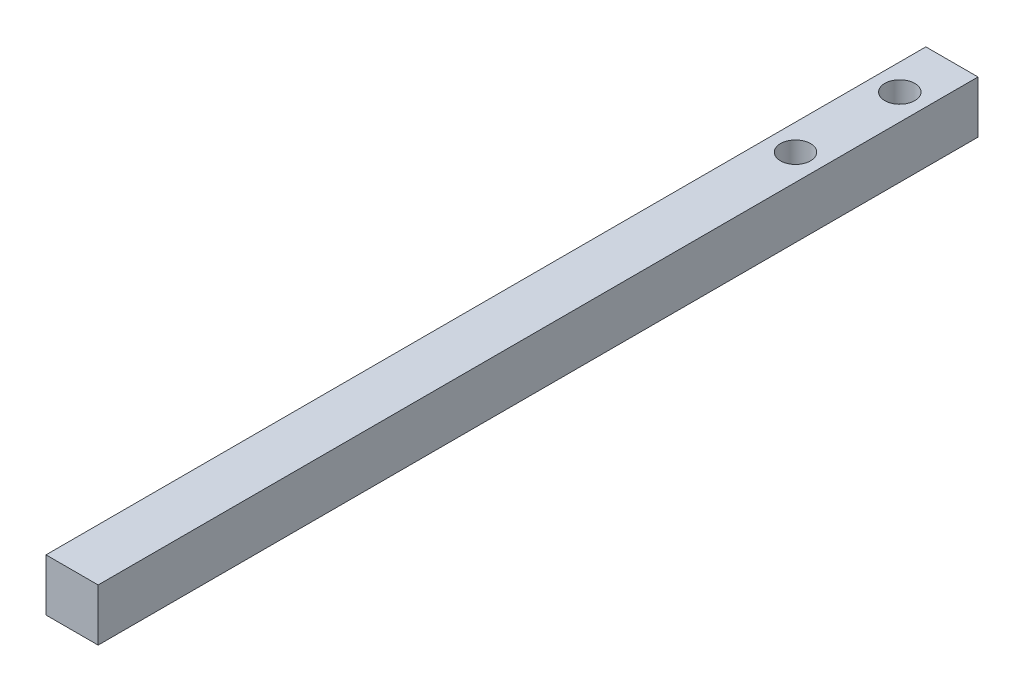
ISO-10303-21;
HEADER;
FILE_DESCRIPTION(('STEP AP214'),'2;1');
FILE_NAME('part.step','',(''),(''),'','','');
FILE_SCHEMA(('AUTOMOTIVE_DESIGN { 1 0 10303 214 1 1 1 1 }'));
ENDSEC;
DATA;
#1=APPLICATION_CONTEXT('core data for automotive mechanical design processes');
#2=APPLICATION_PROTOCOL_DEFINITION('international standard','automotive_design',2000,#1);
#3=PRODUCT_CONTEXT('',#1,'mechanical');
#4=PRODUCT('Part','Part','',(#3));
#5=PRODUCT_RELATED_PRODUCT_CATEGORY('part','',(#4));
#6=PRODUCT_DEFINITION_FORMATION('','',#4);
#7=PRODUCT_DEFINITION_CONTEXT('part definition',#1,'design');
#8=PRODUCT_DEFINITION('design','',#6,#7);
#9=PRODUCT_DEFINITION_SHAPE('','',#8);
#10=(LENGTH_UNIT() NAMED_UNIT(*) SI_UNIT(.MILLI.,.METRE.));
#11=(NAMED_UNIT(*) PLANE_ANGLE_UNIT() SI_UNIT($,.RADIAN.));
#12=(NAMED_UNIT(*) SI_UNIT($,.STERADIAN.) SOLID_ANGLE_UNIT());
#13=UNCERTAINTY_MEASURE_WITH_UNIT(LENGTH_MEASURE(1.E-05),#10,'distance_accuracy_value','');
#14=(GEOMETRIC_REPRESENTATION_CONTEXT(3) GLOBAL_UNCERTAINTY_ASSIGNED_CONTEXT((#13)) GLOBAL_UNIT_ASSIGNED_CONTEXT((#10,
#11,#12)) REPRESENTATION_CONTEXT('',''));
#15=CARTESIAN_POINT('',(0.,0.,0.));
#16=DIRECTION('',(0.,0.,1.));
#17=DIRECTION('',(1.,0.,0.));
#18=AXIS2_PLACEMENT_3D('',#15,#16,#17);
#19=CARTESIAN_POINT('',(-39.751,179.705,0.));
#20=DIRECTION('',(-1.,0.,0.));
#21=DIRECTION('',(0.,0.,1.));
#22=AXIS2_PLACEMENT_3D('',#19,#20,#21);
#23=PLANE('',#22);
#24=DIRECTION('',(0.,1.,0.));
#25=VECTOR('',#24,1.);
#26=CARTESIAN_POINT('',(-39.751,179.705,-87.3124999999999));
#27=LINE('',#26,#25);
#28=CARTESIAN_POINT('',(-39.751,179.705,-87.3124999999999));
#29=VERTEX_POINT('',#28);
#30=CARTESIAN_POINT('',(-39.751,186.055,-87.3124999999999));
#31=VERTEX_POINT('',#30);
#32=EDGE_CURVE('E44',#29,#31,#27,.T.);
#33=ORIENTED_EDGE('',*,*,#32,.T.);
#34=DIRECTION('',(0.,0.,1.));
#35=VECTOR('',#34,1.);
#36=CARTESIAN_POINT('',(-39.751,186.055,0.));
#37=LINE('',#36,#35);
#38=CARTESIAN_POINT('',(-39.751,186.055,19.84375));
#39=VERTEX_POINT('',#38);
#40=EDGE_CURVE('E85',#31,#39,#37,.T.);
#41=ORIENTED_EDGE('',*,*,#40,.T.);
#42=DIRECTION('',(0.,1.,0.));
#43=VECTOR('',#42,1.);
#44=CARTESIAN_POINT('',(-39.751,179.705,19.84375));
#45=LINE('',#44,#43);
#46=CARTESIAN_POINT('',(-39.751,179.705,19.84375));
#47=VERTEX_POINT('',#46);
#48=EDGE_CURVE('E11',#47,#39,#45,.T.);
#49=ORIENTED_EDGE('',*,*,#48,.F.);
#50=DIRECTION('',(0.,0.,1.));
#51=VECTOR('',#50,1.);
#52=CARTESIAN_POINT('',(-39.751,179.705,0.));
#53=LINE('',#52,#51);
#54=EDGE_CURVE('E57',#29,#47,#53,.T.);
#55=ORIENTED_EDGE('',*,*,#54,.F.);
#56=EDGE_LOOP('',(#33,#41,#49,#55));
#57=FACE_BOUND('',#56,.T.);
#58=ADVANCED_FACE('F41',(#57),#23,.F.);
#59=CARTESIAN_POINT('',(0.,179.705,19.84375));
#60=DIRECTION('',(0.,0.,1.));
#61=DIRECTION('',(1.,0.,0.));
#62=AXIS2_PLACEMENT_3D('',#59,#60,#61);
#63=PLANE('',#62);
#64=ORIENTED_EDGE('',*,*,#48,.T.);
#65=DIRECTION('',(1.,0.,0.));
#66=VECTOR('',#65,1.);
#67=CARTESIAN_POINT('',(0.,186.055,19.84375));
#68=LINE('',#67,#66);
#69=CARTESIAN_POINT('',(-46.101,186.055,19.84375));
#70=VERTEX_POINT('',#69);
#71=EDGE_CURVE('E101',#70,#39,#68,.T.);
#72=ORIENTED_EDGE('',*,*,#71,.F.);
#73=DIRECTION('',(0.,1.,0.));
#74=VECTOR('',#73,1.);
#75=CARTESIAN_POINT('',(-46.101,179.705,19.84375));
#76=LINE('',#75,#74);
#77=CARTESIAN_POINT('',(-46.101,179.705,19.84375));
#78=VERTEX_POINT('',#77);
#79=EDGE_CURVE('E49',#78,#70,#76,.T.);
#80=ORIENTED_EDGE('',*,*,#79,.F.);
#81=DIRECTION('',(1.,0.,0.));
#82=VECTOR('',#81,1.);
#83=CARTESIAN_POINT('',(0.,179.705,19.84375));
#84=LINE('',#83,#82);
#85=EDGE_CURVE('E117',#78,#47,#84,.T.);
#86=ORIENTED_EDGE('',*,*,#85,.T.);
#87=EDGE_LOOP('',(#64,#72,#80,#86));
#88=FACE_BOUND('',#87,.T.);
#89=ADVANCED_FACE('F127',(#88),#63,.T.);
#90=CARTESIAN_POINT('',(-46.101,179.705,0.));
#91=DIRECTION('',(-1.,0.,0.));
#92=DIRECTION('',(0.,0.,1.));
#93=AXIS2_PLACEMENT_3D('',#90,#91,#92);
#94=PLANE('',#93);
#95=ORIENTED_EDGE('',*,*,#79,.T.);
#96=DIRECTION('',(0.,0.,1.));
#97=VECTOR('',#96,1.);
#98=CARTESIAN_POINT('',(-46.101,186.055,0.));
#99=LINE('',#98,#97);
#100=CARTESIAN_POINT('',(-46.101,186.055,-87.3124999999999));
#101=VERTEX_POINT('',#100);
#102=EDGE_CURVE('E96',#101,#70,#99,.T.);
#103=ORIENTED_EDGE('',*,*,#102,.F.);
#104=DIRECTION('',(0.,1.,0.));
#105=VECTOR('',#104,1.);
#106=CARTESIAN_POINT('',(-46.101,179.705,-87.3124999999999));
#107=LINE('',#106,#105);
#108=CARTESIAN_POINT('',(-46.101,179.705,-87.3124999999999));
#109=VERTEX_POINT('',#108);
#110=EDGE_CURVE('E88',#109,#101,#107,.T.);
#111=ORIENTED_EDGE('',*,*,#110,.F.);
#112=DIRECTION('',(0.,0.,1.));
#113=VECTOR('',#112,1.);
#114=CARTESIAN_POINT('',(-46.101,179.705,0.));
#115=LINE('',#114,#113);
#116=EDGE_CURVE('E115',#109,#78,#115,.T.);
#117=ORIENTED_EDGE('',*,*,#116,.T.);
#118=EDGE_LOOP('',(#95,#103,#111,#117));
#119=FACE_BOUND('',#118,.T.);
#120=ADVANCED_FACE('F125',(#119),#94,.T.);
#121=CARTESIAN_POINT('',(-42.926,179.705,-68.2625));
#122=DIRECTION('',(0.,1.,0.));
#123=DIRECTION('',(0.,0.,1.));
#124=AXIS2_PLACEMENT_3D('',#121,#122,#123);
#125=CYLINDRICAL_SURFACE('',#124,1.8288);
#126=CARTESIAN_POINT('',(-42.926,179.705,-68.2625));
#127=DIRECTION('',(0.,1.,0.));
#128=DIRECTION('',(0.,0.,1.));
#129=AXIS2_PLACEMENT_3D('',#126,#127,#128);
#130=CIRCLE('',#129,1.8288);
#131=CARTESIAN_POINT('',(-42.926,179.705,-66.4337));
#132=VERTEX_POINT('',#131);
#133=EDGE_CURVE('E119',#132,#132,#130,.F.);
#134=ORIENTED_EDGE('',*,*,#133,.T.);
#135=EDGE_LOOP('',(#134));
#136=FACE_BOUND('',#135,.T.);
#137=CARTESIAN_POINT('',(-42.926,186.055,-68.2625));
#138=DIRECTION('',(0.,1.,0.));
#139=DIRECTION('',(0.,0.,1.));
#140=AXIS2_PLACEMENT_3D('',#137,#138,#139);
#141=CIRCLE('',#140,1.8288);
#142=CARTESIAN_POINT('',(-42.926,186.055,-66.4337));
#143=VERTEX_POINT('',#142);
#144=EDGE_CURVE('E106',#143,#143,#141,.F.);
#145=ORIENTED_EDGE('',*,*,#144,.F.);
#146=EDGE_LOOP('',(#145));
#147=FACE_BOUND('',#146,.T.);
#148=ADVANCED_FACE('F154',(#136,#147),#125,.F.);
#149=CARTESIAN_POINT('',(0.,179.705,-87.3124999999999));
#150=DIRECTION('',(0.,0.,-1.));
#151=DIRECTION('',(-1.,0.,0.));
#152=AXIS2_PLACEMENT_3D('',#149,#150,#151);
#153=PLANE('',#152);
#154=ORIENTED_EDGE('',*,*,#110,.T.);
#155=DIRECTION('',(-1.,0.,0.));
#156=VECTOR('',#155,1.);
#157=CARTESIAN_POINT('',(0.,186.055,-87.3124999999999));
#158=LINE('',#157,#156);
#159=EDGE_CURVE('E91',#31,#101,#158,.T.);
#160=ORIENTED_EDGE('',*,*,#159,.F.);
#161=ORIENTED_EDGE('',*,*,#32,.F.);
#162=DIRECTION('',(-1.,0.,0.));
#163=VECTOR('',#162,1.);
#164=CARTESIAN_POINT('',(0.,179.705,-87.3124999999999));
#165=LINE('',#164,#163);
#166=EDGE_CURVE('E113',#29,#109,#165,.T.);
#167=ORIENTED_EDGE('',*,*,#166,.T.);
#168=EDGE_LOOP('',(#154,#160,#161,#167));
#169=FACE_BOUND('',#168,.T.);
#170=ADVANCED_FACE('F92',(#169),#153,.T.);
#171=CARTESIAN_POINT('',(-42.926,179.705,-80.9624999999999));
#172=DIRECTION('',(0.,1.,0.));
#173=DIRECTION('',(0.,0.,1.));
#174=AXIS2_PLACEMENT_3D('',#171,#172,#173);
#175=CYLINDRICAL_SURFACE('',#174,1.8288);
#176=CARTESIAN_POINT('',(-42.926,179.705,-80.9624999999999));
#177=DIRECTION('',(0.,1.,0.));
#178=DIRECTION('',(0.,0.,1.));
#179=AXIS2_PLACEMENT_3D('',#176,#177,#178);
#180=CIRCLE('',#179,1.8288);
#181=CARTESIAN_POINT('',(-42.926,179.705,-79.1336999999999));
#182=VERTEX_POINT('',#181);
#183=EDGE_CURVE('E89',#182,#182,#180,.T.);
#184=ORIENTED_EDGE('',*,*,#183,.F.);
#185=EDGE_LOOP('',(#184));
#186=FACE_BOUND('',#185,.T.);
#187=CARTESIAN_POINT('',(-42.926,186.055,-80.9624999999999));
#188=DIRECTION('',(0.,1.,0.));
#189=DIRECTION('',(0.,0.,1.));
#190=AXIS2_PLACEMENT_3D('',#187,#188,#189);
#191=CIRCLE('',#190,1.8288);
#192=CARTESIAN_POINT('',(-42.926,186.055,-79.1336999999999));
#193=VERTEX_POINT('',#192);
#194=EDGE_CURVE('E109',#193,#193,#191,.T.);
#195=ORIENTED_EDGE('',*,*,#194,.T.);
#196=EDGE_LOOP('',(#195));
#197=FACE_BOUND('',#196,.T.);
#198=ADVANCED_FACE('F131',(#186,#197),#175,.F.);
#199=CARTESIAN_POINT('',(0.,179.705,0.));
#200=DIRECTION('',(0.,1.,0.));
#201=DIRECTION('',(0.,0.,1.));
#202=AXIS2_PLACEMENT_3D('',#199,#200,#201);
#203=PLANE('',#202);
#204=ORIENTED_EDGE('',*,*,#54,.T.);
#205=ORIENTED_EDGE('',*,*,#85,.F.);
#206=ORIENTED_EDGE('',*,*,#116,.F.);
#207=ORIENTED_EDGE('',*,*,#166,.F.);
#208=EDGE_LOOP('',(#204,#205,#206,#207));
#209=FACE_BOUND('',#208,.T.);
#210=ORIENTED_EDGE('',*,*,#133,.F.);
#211=EDGE_LOOP('',(#210));
#212=FACE_BOUND('',#211,.T.);
#213=ORIENTED_EDGE('',*,*,#183,.T.);
#214=EDGE_LOOP('',(#213));
#215=FACE_BOUND('',#214,.T.);
#216=ADVANCED_FACE('F128',(#209,#212,#215),#203,.F.);
#217=CARTESIAN_POINT('',(0.,186.055,0.));
#218=DIRECTION('',(0.,1.,0.));
#219=DIRECTION('',(0.,0.,1.));
#220=AXIS2_PLACEMENT_3D('',#217,#218,#219);
#221=PLANE('',#220);
#222=ORIENTED_EDGE('',*,*,#40,.F.);
#223=ORIENTED_EDGE('',*,*,#159,.T.);
#224=ORIENTED_EDGE('',*,*,#102,.T.);
#225=ORIENTED_EDGE('',*,*,#71,.T.);
#226=EDGE_LOOP('',(#222,#223,#224,#225));
#227=FACE_BOUND('',#226,.T.);
#228=ORIENTED_EDGE('',*,*,#144,.T.);
#229=EDGE_LOOP('',(#228));
#230=FACE_BOUND('',#229,.T.);
#231=ORIENTED_EDGE('',*,*,#194,.F.);
#232=EDGE_LOOP('',(#231));
#233=FACE_BOUND('',#232,.T.);
#234=ADVANCED_FACE('F99',(#227,#230,#233),#221,.T.);
#235=CLOSED_SHELL('',(#58,#89,#120,#148,#170,#198,#216,#234));
#236=MANIFOLD_SOLID_BREP('B2',#235);
#237=ADVANCED_BREP_SHAPE_REPRESENTATION('',(#18,#236),#14);
#238=SHAPE_DEFINITION_REPRESENTATION(#9,#237);
ENDSEC;
END-ISO-10303-21;
